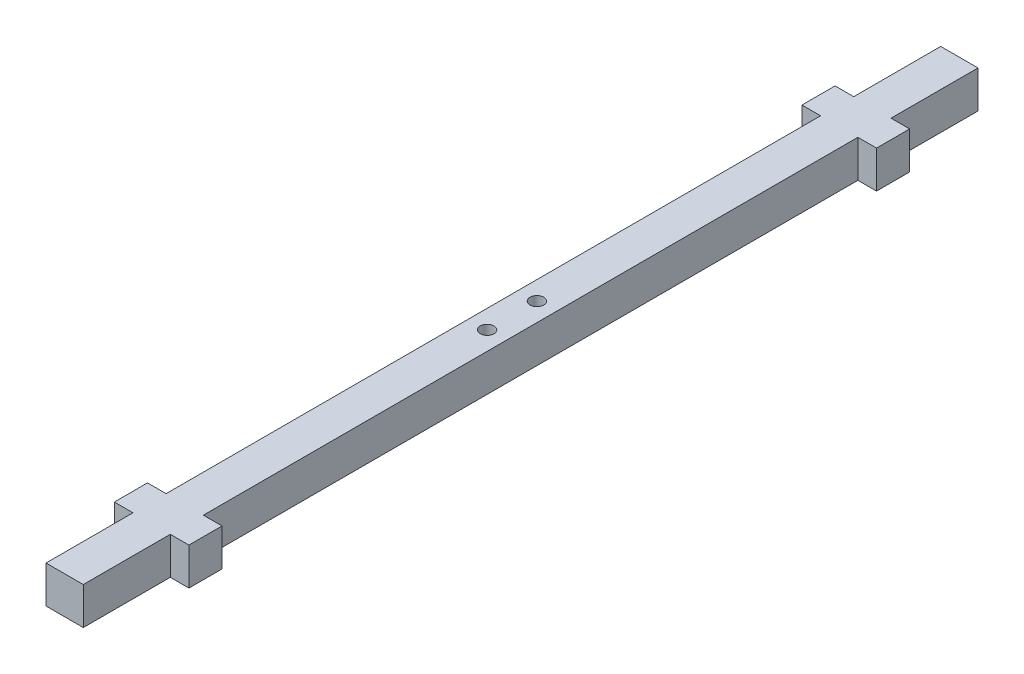
ISO-10303-21;
HEADER;
FILE_DESCRIPTION(('STEP AP214'),'2;1');
FILE_NAME('part.step','',(''),(''),'','','');
FILE_SCHEMA(('AUTOMOTIVE_DESIGN { 1 0 10303 214 1 1 1 1 }'));
ENDSEC;
DATA;
#1=APPLICATION_CONTEXT('core data for automotive mechanical design processes');
#2=APPLICATION_PROTOCOL_DEFINITION('international standard','automotive_design',2000,#1);
#3=PRODUCT_CONTEXT('',#1,'mechanical');
#4=PRODUCT('Part','Part','',(#3));
#5=PRODUCT_RELATED_PRODUCT_CATEGORY('part','',(#4));
#6=PRODUCT_DEFINITION_FORMATION('','',#4);
#7=PRODUCT_DEFINITION_CONTEXT('part definition',#1,'design');
#8=PRODUCT_DEFINITION('design','',#6,#7);
#9=PRODUCT_DEFINITION_SHAPE('','',#8);
#10=(LENGTH_UNIT() NAMED_UNIT(*) SI_UNIT(.MILLI.,.METRE.));
#11=(NAMED_UNIT(*) PLANE_ANGLE_UNIT() SI_UNIT($,.RADIAN.));
#12=(NAMED_UNIT(*) SI_UNIT($,.STERADIAN.) SOLID_ANGLE_UNIT());
#13=UNCERTAINTY_MEASURE_WITH_UNIT(LENGTH_MEASURE(1.E-05),#10,'distance_accuracy_value','');
#14=(GEOMETRIC_REPRESENTATION_CONTEXT(3) GLOBAL_UNCERTAINTY_ASSIGNED_CONTEXT((#13)) GLOBAL_UNIT_ASSIGNED_CONTEXT((#10,
#11,#12)) REPRESENTATION_CONTEXT('',''));
#15=CARTESIAN_POINT('',(0.,0.,0.));
#16=DIRECTION('',(0.,0.,1.));
#17=DIRECTION('',(1.,0.,0.));
#18=AXIS2_PLACEMENT_3D('',#15,#16,#17);
#19=CARTESIAN_POINT('',(4.5,-4.5,108.));
#20=DIRECTION('',(-1.,0.,0.));
#21=DIRECTION('',(0.,0.,1.));
#22=AXIS2_PLACEMENT_3D('',#19,#20,#21);
#23=PLANE('',#22);
#24=DIRECTION('',(0.,1.,0.));
#25=VECTOR('',#24,1.);
#26=CARTESIAN_POINT('',(4.5,-4.5,79.));
#27=LINE('',#26,#25);
#28=CARTESIAN_POINT('',(4.5,-4.5,79.));
#29=VERTEX_POINT('',#28);
#30=CARTESIAN_POINT('',(4.5,4.5,79.));
#31=VERTEX_POINT('',#30);
#32=EDGE_CURVE('E224',#29,#31,#27,.T.);
#33=ORIENTED_EDGE('',*,*,#32,.F.);
#34=DIRECTION('',(0.,0.,-1.));
#35=VECTOR('',#34,1.);
#36=CARTESIAN_POINT('',(4.5,-4.5,108.));
#37=LINE('',#36,#35);
#38=CARTESIAN_POINT('',(4.5,-4.5,-79.));
#39=VERTEX_POINT('',#38);
#40=EDGE_CURVE('E301',#29,#39,#37,.T.);
#41=ORIENTED_EDGE('',*,*,#40,.T.);
#42=DIRECTION('',(0.,-1.,0.));
#43=VECTOR('',#42,1.);
#44=CARTESIAN_POINT('',(4.5,-4.5,-79.));
#45=LINE('',#44,#43);
#46=CARTESIAN_POINT('',(4.5,4.5,-79.));
#47=VERTEX_POINT('',#46);
#48=EDGE_CURVE('E267',#47,#39,#45,.T.);
#49=ORIENTED_EDGE('',*,*,#48,.F.);
#50=DIRECTION('',(0.,0.,-1.));
#51=VECTOR('',#50,1.);
#52=CARTESIAN_POINT('',(4.5,4.5,108.));
#53=LINE('',#52,#51);
#54=EDGE_CURVE('E47',#31,#47,#53,.T.);
#55=ORIENTED_EDGE('',*,*,#54,.F.);
#56=EDGE_LOOP('',(#33,#41,#49,#55));
#57=FACE_BOUND('',#56,.T.);
#58=ADVANCED_FACE('F39',(#57),#23,.F.);
#59=DIRECTION('',(0.,-1.,0.));
#60=VECTOR('',#59,1.);
#61=CARTESIAN_POINT('',(4.5,-4.5,87.));
#62=LINE('',#61,#60);
#63=CARTESIAN_POINT('',(4.5,4.5,87.));
#64=VERTEX_POINT('',#63);
#65=CARTESIAN_POINT('',(4.5,-4.5,87.));
#66=VERTEX_POINT('',#65);
#67=EDGE_CURVE('E62',#64,#66,#62,.T.);
#68=ORIENTED_EDGE('',*,*,#67,.F.);
#69=CARTESIAN_POINT('',(4.5,4.5,108.));
#70=VERTEX_POINT('',#69);
#71=EDGE_CURVE('E11',#70,#64,#53,.T.);
#72=ORIENTED_EDGE('',*,*,#71,.F.);
#73=DIRECTION('',(0.,1.,0.));
#74=VECTOR('',#73,1.);
#75=CARTESIAN_POINT('',(4.5,-4.5,108.));
#76=LINE('',#75,#74);
#77=CARTESIAN_POINT('',(4.5,-4.5,108.));
#78=VERTEX_POINT('',#77);
#79=EDGE_CURVE('E277',#78,#70,#76,.T.);
#80=ORIENTED_EDGE('',*,*,#79,.F.);
#81=EDGE_CURVE('E298',#78,#66,#37,.T.);
#82=ORIENTED_EDGE('',*,*,#81,.T.);
#83=EDGE_LOOP('',(#68,#72,#80,#82));
#84=FACE_BOUND('',#83,.T.);
#85=ADVANCED_FACE('F359',(#84),#23,.F.);
#86=CARTESIAN_POINT('',(-4.5,-4.5,108.));
#87=DIRECTION('',(1.,0.,0.));
#88=DIRECTION('',(0.,0.,-1.));
#89=AXIS2_PLACEMENT_3D('',#86,#87,#88);
#90=PLANE('',#89);
#91=DIRECTION('',(0.,-1.,0.));
#92=VECTOR('',#91,1.);
#93=CARTESIAN_POINT('',(-4.5,-4.5,79.));
#94=LINE('',#93,#92);
#95=CARTESIAN_POINT('',(-4.5,4.5,79.));
#96=VERTEX_POINT('',#95);
#97=CARTESIAN_POINT('',(-4.5,-4.5,79.));
#98=VERTEX_POINT('',#97);
#99=EDGE_CURVE('E221',#96,#98,#94,.T.);
#100=ORIENTED_EDGE('',*,*,#99,.F.);
#101=DIRECTION('',(0.,0.,-1.));
#102=VECTOR('',#101,1.);
#103=CARTESIAN_POINT('',(-4.5,4.5,108.));
#104=LINE('',#103,#102);
#105=CARTESIAN_POINT('',(-4.5,4.5,-79.));
#106=VERTEX_POINT('',#105);
#107=EDGE_CURVE('E307',#96,#106,#104,.T.);
#108=ORIENTED_EDGE('',*,*,#107,.T.);
#109=DIRECTION('',(0.,1.,0.));
#110=VECTOR('',#109,1.);
#111=CARTESIAN_POINT('',(-4.5,-4.5,-79.));
#112=LINE('',#111,#110);
#113=CARTESIAN_POINT('',(-4.5,-4.5,-79.));
#114=VERTEX_POINT('',#113);
#115=EDGE_CURVE('E264',#114,#106,#112,.T.);
#116=ORIENTED_EDGE('',*,*,#115,.F.);
#117=DIRECTION('',(0.,0.,-1.));
#118=VECTOR('',#117,1.);
#119=CARTESIAN_POINT('',(-4.5,-4.5,108.));
#120=LINE('',#119,#118);
#121=EDGE_CURVE('E304',#98,#114,#120,.T.);
#122=ORIENTED_EDGE('',*,*,#121,.F.);
#123=EDGE_LOOP('',(#100,#108,#116,#122));
#124=FACE_BOUND('',#123,.T.);
#125=ADVANCED_FACE('F337',(#124),#90,.F.);
#126=DIRECTION('',(0.,1.,0.));
#127=VECTOR('',#126,1.);
#128=CARTESIAN_POINT('',(-4.5,-4.5,87.));
#129=LINE('',#128,#127);
#130=CARTESIAN_POINT('',(-4.5,-4.5,87.));
#131=VERTEX_POINT('',#130);
#132=CARTESIAN_POINT('',(-4.5,4.5,87.));
#133=VERTEX_POINT('',#132);
#134=EDGE_CURVE('E203',#131,#133,#129,.T.);
#135=ORIENTED_EDGE('',*,*,#134,.F.);
#136=CARTESIAN_POINT('',(-4.5,-4.5,108.));
#137=VERTEX_POINT('',#136);
#138=EDGE_CURVE('E302',#137,#131,#120,.T.);
#139=ORIENTED_EDGE('',*,*,#138,.F.);
#140=DIRECTION('',(0.,-1.,0.));
#141=VECTOR('',#140,1.);
#142=CARTESIAN_POINT('',(-4.5,-4.5,108.));
#143=LINE('',#142,#141);
#144=CARTESIAN_POINT('',(-4.5,4.5,108.));
#145=VERTEX_POINT('',#144);
#146=EDGE_CURVE('E283',#145,#137,#143,.T.);
#147=ORIENTED_EDGE('',*,*,#146,.F.);
#148=EDGE_CURVE('E305',#145,#133,#104,.T.);
#149=ORIENTED_EDGE('',*,*,#148,.T.);
#150=EDGE_LOOP('',(#135,#139,#147,#149));
#151=FACE_BOUND('',#150,.T.);
#152=ADVANCED_FACE('F365',(#151),#90,.F.);
#153=DIRECTION('',(0.,1.,0.));
#154=VECTOR('',#153,1.);
#155=CARTESIAN_POINT('',(4.5,-4.5,-87.));
#156=LINE('',#155,#154);
#157=CARTESIAN_POINT('',(4.5,-4.5,-87.));
#158=VERTEX_POINT('',#157);
#159=CARTESIAN_POINT('',(4.5,4.5,-87.));
#160=VERTEX_POINT('',#159);
#161=EDGE_CURVE('E273',#158,#160,#156,.T.);
#162=ORIENTED_EDGE('',*,*,#161,.F.);
#163=CARTESIAN_POINT('',(4.5,-4.5,-108.));
#164=VERTEX_POINT('',#163);
#165=EDGE_CURVE('E287',#158,#164,#37,.T.);
#166=ORIENTED_EDGE('',*,*,#165,.T.);
#167=DIRECTION('',(0.,1.,0.));
#168=VECTOR('',#167,1.);
#169=CARTESIAN_POINT('',(4.5,-4.5,-108.));
#170=LINE('',#169,#168);
#171=CARTESIAN_POINT('',(4.5,4.5,-108.));
#172=VERTEX_POINT('',#171);
#173=EDGE_CURVE('E276',#164,#172,#170,.T.);
#174=ORIENTED_EDGE('',*,*,#173,.T.);
#175=EDGE_CURVE('E48',#160,#172,#53,.T.);
#176=ORIENTED_EDGE('',*,*,#175,.F.);
#177=EDGE_LOOP('',(#162,#166,#174,#176));
#178=FACE_BOUND('',#177,.T.);
#179=ADVANCED_FACE('F41',(#178),#23,.F.);
#180=DIRECTION('',(0.,-1.,0.));
#181=VECTOR('',#180,1.);
#182=CARTESIAN_POINT('',(-4.5,-4.5,-87.));
#183=LINE('',#182,#181);
#184=CARTESIAN_POINT('',(-4.5,4.5,-87.));
#185=VERTEX_POINT('',#184);
#186=CARTESIAN_POINT('',(-4.5,-4.5,-87.));
#187=VERTEX_POINT('',#186);
#188=EDGE_CURVE('E270',#185,#187,#183,.T.);
#189=ORIENTED_EDGE('',*,*,#188,.F.);
#190=CARTESIAN_POINT('',(-4.5,4.5,-108.));
#191=VERTEX_POINT('',#190);
#192=EDGE_CURVE('E303',#185,#191,#104,.T.);
#193=ORIENTED_EDGE('',*,*,#192,.T.);
#194=DIRECTION('',(0.,-1.,0.));
#195=VECTOR('',#194,1.);
#196=CARTESIAN_POINT('',(-4.5,-4.5,-108.));
#197=LINE('',#196,#195);
#198=CARTESIAN_POINT('',(-4.5,-4.5,-108.));
#199=VERTEX_POINT('',#198);
#200=EDGE_CURVE('E293',#191,#199,#197,.T.);
#201=ORIENTED_EDGE('',*,*,#200,.T.);
#202=EDGE_CURVE('E300',#187,#199,#120,.T.);
#203=ORIENTED_EDGE('',*,*,#202,.F.);
#204=EDGE_LOOP('',(#189,#193,#201,#203));
#205=FACE_BOUND('',#204,.T.);
#206=ADVANCED_FACE('F315',(#205),#90,.F.);
#207=CARTESIAN_POINT('',(-4.5,4.5,108.));
#208=DIRECTION('',(0.,-1.,0.));
#209=DIRECTION('',(0.,0.,-1.));
#210=AXIS2_PLACEMENT_3D('',#207,#208,#209);
#211=PLANE('',#210);
#212=CARTESIAN_POINT('',(0.,4.5,-6.));
#213=DIRECTION('',(0.,-1.,0.));
#214=DIRECTION('',(0.,0.,-1.));
#215=AXIS2_PLACEMENT_3D('',#212,#213,#214);
#216=CIRCLE('',#215,1.65);
#217=CARTESIAN_POINT('',(0.,4.5,-7.65));
#218=VERTEX_POINT('',#217);
#219=EDGE_CURVE('E385',#218,#218,#216,.T.);
#220=ORIENTED_EDGE('',*,*,#219,.T.);
#221=EDGE_LOOP('',(#220));
#222=FACE_BOUND('',#221,.T.);
#223=CARTESIAN_POINT('',(0.,4.5,6.));
#224=DIRECTION('',(0.,-1.,0.));
#225=DIRECTION('',(0.,0.,-1.));
#226=AXIS2_PLACEMENT_3D('',#223,#224,#225);
#227=CIRCLE('',#226,1.65);
#228=CARTESIAN_POINT('',(0.,4.5,4.35));
#229=VERTEX_POINT('',#228);
#230=EDGE_CURVE('E390',#229,#229,#227,.T.);
#231=ORIENTED_EDGE('',*,*,#230,.T.);
#232=EDGE_LOOP('',(#231));
#233=FACE_BOUND('',#232,.T.);
#234=ORIENTED_EDGE('',*,*,#71,.T.);
#235=DIRECTION('',(1.,0.,0.));
#236=VECTOR('',#235,1.);
#237=CARTESIAN_POINT('',(-9.00000000000001,4.5,87.));
#238=LINE('',#237,#236);
#239=CARTESIAN_POINT('',(9.,4.5,87.));
#240=VERTEX_POINT('',#239);
#241=EDGE_CURVE('E195',#64,#240,#238,.T.);
#242=ORIENTED_EDGE('',*,*,#241,.T.);
#243=DIRECTION('',(0.,0.,-1.));
#244=VECTOR('',#243,1.);
#245=CARTESIAN_POINT('',(9.,4.5,87.));
#246=LINE('',#245,#244);
#247=CARTESIAN_POINT('',(9.,4.5,79.));
#248=VERTEX_POINT('',#247);
#249=EDGE_CURVE('E187',#240,#248,#246,.T.);
#250=ORIENTED_EDGE('',*,*,#249,.T.);
#251=DIRECTION('',(-1.,0.,0.));
#252=VECTOR('',#251,1.);
#253=CARTESIAN_POINT('',(-9.00000000000001,4.5,79.));
#254=LINE('',#253,#252);
#255=EDGE_CURVE('E216',#248,#31,#254,.T.);
#256=ORIENTED_EDGE('',*,*,#255,.T.);
#257=ORIENTED_EDGE('',*,*,#54,.T.);
#258=DIRECTION('',(1.,0.,0.));
#259=VECTOR('',#258,1.);
#260=CARTESIAN_POINT('',(-9.,4.5,-79.));
#261=LINE('',#260,#259);
#262=CARTESIAN_POINT('',(9.,4.5,-79.));
#263=VERTEX_POINT('',#262);
#264=EDGE_CURVE('E237',#47,#263,#261,.T.);
#265=ORIENTED_EDGE('',*,*,#264,.T.);
#266=DIRECTION('',(0.,0.,-1.));
#267=VECTOR('',#266,1.);
#268=CARTESIAN_POINT('',(9.,4.5,-79.));
#269=LINE('',#268,#267);
#270=CARTESIAN_POINT('',(9.,4.5,-87.));
#271=VERTEX_POINT('',#270);
#272=EDGE_CURVE('E227',#263,#271,#269,.T.);
#273=ORIENTED_EDGE('',*,*,#272,.T.);
#274=DIRECTION('',(-1.,0.,0.));
#275=VECTOR('',#274,1.);
#276=CARTESIAN_POINT('',(-9.,4.5,-87.));
#277=LINE('',#276,#275);
#278=EDGE_CURVE('E232',#271,#160,#277,.T.);
#279=ORIENTED_EDGE('',*,*,#278,.T.);
#280=ORIENTED_EDGE('',*,*,#175,.T.);
#281=DIRECTION('',(-1.,0.,0.));
#282=VECTOR('',#281,1.);
#283=CARTESIAN_POINT('',(-4.5,4.5,-108.));
#284=LINE('',#283,#282);
#285=EDGE_CURVE('E290',#172,#191,#284,.T.);
#286=ORIENTED_EDGE('',*,*,#285,.T.);
#287=ORIENTED_EDGE('',*,*,#192,.F.);
#288=CARTESIAN_POINT('',(-9.,4.5,-87.));
#289=VERTEX_POINT('',#288);
#290=EDGE_CURVE('E230',#185,#289,#277,.T.);
#291=ORIENTED_EDGE('',*,*,#290,.T.);
#292=DIRECTION('',(0.,0.,1.));
#293=VECTOR('',#292,1.);
#294=CARTESIAN_POINT('',(-9.,4.5,-79.));
#295=LINE('',#294,#293);
#296=CARTESIAN_POINT('',(-9.,4.5,-79.));
#297=VERTEX_POINT('',#296);
#298=EDGE_CURVE('E235',#289,#297,#295,.T.);
#299=ORIENTED_EDGE('',*,*,#298,.T.);
#300=EDGE_CURVE('E238',#297,#106,#261,.T.);
#301=ORIENTED_EDGE('',*,*,#300,.T.);
#302=ORIENTED_EDGE('',*,*,#107,.F.);
#303=CARTESIAN_POINT('',(-9.00000000000001,4.5,79.));
#304=VERTEX_POINT('',#303);
#305=EDGE_CURVE('E215',#96,#304,#254,.T.);
#306=ORIENTED_EDGE('',*,*,#305,.T.);
#307=DIRECTION('',(0.,0.,1.));
#308=VECTOR('',#307,1.);
#309=CARTESIAN_POINT('',(-9.00000000000001,4.5,87.));
#310=LINE('',#309,#308);
#311=CARTESIAN_POINT('',(-9.00000000000001,4.5,87.));
#312=VERTEX_POINT('',#311);
#313=EDGE_CURVE('E213',#304,#312,#310,.T.);
#314=ORIENTED_EDGE('',*,*,#313,.T.);
#315=EDGE_CURVE('E210',#312,#133,#238,.T.);
#316=ORIENTED_EDGE('',*,*,#315,.T.);
#317=ORIENTED_EDGE('',*,*,#148,.F.);
#318=DIRECTION('',(-1.,0.,0.));
#319=VECTOR('',#318,1.);
#320=CARTESIAN_POINT('',(-4.5,4.5,108.));
#321=LINE('',#320,#319);
#322=EDGE_CURVE('E280',#70,#145,#321,.T.);
#323=ORIENTED_EDGE('',*,*,#322,.F.);
#324=EDGE_LOOP('',(#234,#242,#250,#256,#257,#265,#273,#279,#280,#286,#287,#291,#299,#301,#302,
#306,#314,#316,#317,#323));
#325=FACE_BOUND('',#324,.T.);
#326=ADVANCED_FACE('F321',(#222,#233,#325),#211,.F.);
#327=CARTESIAN_POINT('',(-4.5,-4.5,108.));
#328=DIRECTION('',(0.,1.,0.));
#329=DIRECTION('',(0.,0.,1.));
#330=AXIS2_PLACEMENT_3D('',#327,#328,#329);
#331=PLANE('',#330);
#332=CARTESIAN_POINT('',(0.,-4.5,-6.));
#333=DIRECTION('',(0.,1.,0.));
#334=DIRECTION('',(0.,0.,1.));
#335=AXIS2_PLACEMENT_3D('',#332,#333,#334);
#336=CIRCLE('',#335,1.65);
#337=CARTESIAN_POINT('',(0.,-4.5,-4.35));
#338=VERTEX_POINT('',#337);
#339=EDGE_CURVE('E429',#338,#338,#336,.T.);
#340=ORIENTED_EDGE('',*,*,#339,.T.);
#341=EDGE_LOOP('',(#340));
#342=FACE_BOUND('',#341,.T.);
#343=CARTESIAN_POINT('',(0.,-4.5,6.));
#344=DIRECTION('',(0.,1.,0.));
#345=DIRECTION('',(0.,0.,1.));
#346=AXIS2_PLACEMENT_3D('',#343,#344,#345);
#347=CIRCLE('',#346,1.65);
#348=CARTESIAN_POINT('',(0.,-4.5,7.65));
#349=VERTEX_POINT('',#348);
#350=EDGE_CURVE('E431',#349,#349,#347,.T.);
#351=ORIENTED_EDGE('',*,*,#350,.T.);
#352=EDGE_LOOP('',(#351));
#353=FACE_BOUND('',#352,.T.);
#354=ORIENTED_EDGE('',*,*,#138,.T.);
#355=DIRECTION('',(1.,0.,0.));
#356=VECTOR('',#355,1.);
#357=CARTESIAN_POINT('',(-9.00000000000001,-4.5,87.));
#358=LINE('',#357,#356);
#359=CARTESIAN_POINT('',(-9.00000000000001,-4.5,87.));
#360=VERTEX_POINT('',#359);
#361=EDGE_CURVE('E186',#360,#131,#358,.T.);
#362=ORIENTED_EDGE('',*,*,#361,.F.);
#363=DIRECTION('',(0.,0.,1.));
#364=VECTOR('',#363,1.);
#365=CARTESIAN_POINT('',(-9.00000000000001,-4.5,87.));
#366=LINE('',#365,#364);
#367=CARTESIAN_POINT('',(-9.00000000000001,-4.5,79.));
#368=VERTEX_POINT('',#367);
#369=EDGE_CURVE('E395',#368,#360,#366,.T.);
#370=ORIENTED_EDGE('',*,*,#369,.F.);
#371=DIRECTION('',(-1.,0.,0.));
#372=VECTOR('',#371,1.);
#373=CARTESIAN_POINT('',(-9.00000000000001,-4.5,79.));
#374=LINE('',#373,#372);
#375=EDGE_CURVE('E206',#98,#368,#374,.T.);
#376=ORIENTED_EDGE('',*,*,#375,.F.);
#377=ORIENTED_EDGE('',*,*,#121,.T.);
#378=DIRECTION('',(1.,0.,0.));
#379=VECTOR('',#378,1.);
#380=CARTESIAN_POINT('',(-9.,-4.5,-79.));
#381=LINE('',#380,#379);
#382=CARTESIAN_POINT('',(-9.,-4.5,-79.));
#383=VERTEX_POINT('',#382);
#384=EDGE_CURVE('E231',#383,#114,#381,.T.);
#385=ORIENTED_EDGE('',*,*,#384,.F.);
#386=DIRECTION('',(0.,0.,1.));
#387=VECTOR('',#386,1.);
#388=CARTESIAN_POINT('',(-9.,-4.5,-79.));
#389=LINE('',#388,#387);
#390=CARTESIAN_POINT('',(-9.,-4.5,-87.));
#391=VERTEX_POINT('',#390);
#392=EDGE_CURVE('E248',#391,#383,#389,.T.);
#393=ORIENTED_EDGE('',*,*,#392,.F.);
#394=DIRECTION('',(-1.,0.,0.));
#395=VECTOR('',#394,1.);
#396=CARTESIAN_POINT('',(-9.,-4.5,-87.));
#397=LINE('',#396,#395);
#398=EDGE_CURVE('E244',#187,#391,#397,.T.);
#399=ORIENTED_EDGE('',*,*,#398,.F.);
#400=ORIENTED_EDGE('',*,*,#202,.T.);
#401=DIRECTION('',(1.,0.,0.));
#402=VECTOR('',#401,1.);
#403=CARTESIAN_POINT('',(-4.5,-4.5,-108.));
#404=LINE('',#403,#402);
#405=EDGE_CURVE('E281',#199,#164,#404,.T.);
#406=ORIENTED_EDGE('',*,*,#405,.T.);
#407=ORIENTED_EDGE('',*,*,#165,.F.);
#408=CARTESIAN_POINT('',(9.,-4.5,-87.));
#409=VERTEX_POINT('',#408);
#410=EDGE_CURVE('E245',#409,#158,#397,.T.);
#411=ORIENTED_EDGE('',*,*,#410,.F.);
#412=DIRECTION('',(0.,0.,-1.));
#413=VECTOR('',#412,1.);
#414=CARTESIAN_POINT('',(9.,-4.5,-79.));
#415=LINE('',#414,#413);
#416=CARTESIAN_POINT('',(9.,-4.5,-79.));
#417=VERTEX_POINT('',#416);
#418=EDGE_CURVE('E226',#417,#409,#415,.T.);
#419=ORIENTED_EDGE('',*,*,#418,.F.);
#420=EDGE_CURVE('E250',#39,#417,#381,.T.);
#421=ORIENTED_EDGE('',*,*,#420,.F.);
#422=ORIENTED_EDGE('',*,*,#40,.F.);
#423=CARTESIAN_POINT('',(9.,-4.5,79.));
#424=VERTEX_POINT('',#423);
#425=EDGE_CURVE('E201',#424,#29,#374,.T.);
#426=ORIENTED_EDGE('',*,*,#425,.F.);
#427=DIRECTION('',(0.,0.,-1.));
#428=VECTOR('',#427,1.);
#429=CARTESIAN_POINT('',(9.,-4.5,87.));
#430=LINE('',#429,#428);
#431=CARTESIAN_POINT('',(9.,-4.5,87.));
#432=VERTEX_POINT('',#431);
#433=EDGE_CURVE('E193',#432,#424,#430,.T.);
#434=ORIENTED_EDGE('',*,*,#433,.F.);
#435=EDGE_CURVE('E177',#66,#432,#358,.T.);
#436=ORIENTED_EDGE('',*,*,#435,.F.);
#437=ORIENTED_EDGE('',*,*,#81,.F.);
#438=DIRECTION('',(1.,0.,0.));
#439=VECTOR('',#438,1.);
#440=CARTESIAN_POINT('',(-4.5,-4.5,108.));
#441=LINE('',#440,#439);
#442=EDGE_CURVE('E285',#137,#78,#441,.T.);
#443=ORIENTED_EDGE('',*,*,#442,.F.);
#444=EDGE_LOOP('',(#354,#362,#370,#376,#377,#385,#393,#399,#400,#406,#407,#411,#419,#421,#422,
#426,#434,#436,#437,#443));
#445=FACE_BOUND('',#444,.T.);
#446=ADVANCED_FACE('F199',(#342,#353,#445),#331,.F.);
#447=CARTESIAN_POINT('',(0.,0.,108.));
#448=DIRECTION('',(0.,0.,-1.));
#449=DIRECTION('',(-1.,0.,0.));
#450=AXIS2_PLACEMENT_3D('',#447,#448,#449);
#451=PLANE('',#450);
#452=ORIENTED_EDGE('',*,*,#79,.T.);
#453=ORIENTED_EDGE('',*,*,#322,.T.);
#454=ORIENTED_EDGE('',*,*,#146,.T.);
#455=ORIENTED_EDGE('',*,*,#442,.T.);
#456=EDGE_LOOP('',(#452,#453,#454,#455));
#457=FACE_BOUND('',#456,.T.);
#458=ADVANCED_FACE('F410',(#457),#451,.F.);
#459=CARTESIAN_POINT('',(0.,0.,-108.));
#460=DIRECTION('',(0.,0.,-1.));
#461=DIRECTION('',(-1.,0.,0.));
#462=AXIS2_PLACEMENT_3D('',#459,#460,#461);
#463=PLANE('',#462);
#464=ORIENTED_EDGE('',*,*,#173,.F.);
#465=ORIENTED_EDGE('',*,*,#405,.F.);
#466=ORIENTED_EDGE('',*,*,#200,.F.);
#467=ORIENTED_EDGE('',*,*,#285,.F.);
#468=EDGE_LOOP('',(#464,#465,#466,#467));
#469=FACE_BOUND('',#468,.T.);
#470=ADVANCED_FACE('F324',(#469),#463,.T.);
#471=CARTESIAN_POINT('',(-9.,4.5,-79.));
#472=DIRECTION('',(1.,0.,0.));
#473=DIRECTION('',(0.,0.,-1.));
#474=AXIS2_PLACEMENT_3D('',#471,#472,#473);
#475=PLANE('',#474);
#476=ORIENTED_EDGE('',*,*,#392,.T.);
#477=DIRECTION('',(0.,-1.,0.));
#478=VECTOR('',#477,1.);
#479=CARTESIAN_POINT('',(-9.,4.5,-79.));
#480=LINE('',#479,#478);
#481=EDGE_CURVE('E255',#297,#383,#480,.T.);
#482=ORIENTED_EDGE('',*,*,#481,.F.);
#483=ORIENTED_EDGE('',*,*,#298,.F.);
#484=DIRECTION('',(0.,-1.,0.));
#485=VECTOR('',#484,1.);
#486=CARTESIAN_POINT('',(-9.,4.5,-87.));
#487=LINE('',#486,#485);
#488=EDGE_CURVE('E258',#289,#391,#487,.T.);
#489=ORIENTED_EDGE('',*,*,#488,.T.);
#490=EDGE_LOOP('',(#476,#482,#483,#489));
#491=FACE_BOUND('',#490,.T.);
#492=ADVANCED_FACE('F343',(#491),#475,.F.);
#493=CARTESIAN_POINT('',(-9.,4.5,-79.));
#494=DIRECTION('',(0.,0.,-1.));
#495=DIRECTION('',(-1.,0.,0.));
#496=AXIS2_PLACEMENT_3D('',#493,#494,#495);
#497=PLANE('',#496);
#498=ORIENTED_EDGE('',*,*,#384,.T.);
#499=ORIENTED_EDGE('',*,*,#115,.T.);
#500=ORIENTED_EDGE('',*,*,#300,.F.);
#501=ORIENTED_EDGE('',*,*,#481,.T.);
#502=EDGE_LOOP('',(#498,#499,#500,#501));
#503=FACE_BOUND('',#502,.T.);
#504=ADVANCED_FACE('F334',(#503),#497,.F.);
#505=CARTESIAN_POINT('',(-9.,4.5,-87.));
#506=DIRECTION('',(0.,0.,1.));
#507=DIRECTION('',(1.,0.,0.));
#508=AXIS2_PLACEMENT_3D('',#505,#506,#507);
#509=PLANE('',#508);
#510=ORIENTED_EDGE('',*,*,#290,.F.);
#511=ORIENTED_EDGE('',*,*,#188,.T.);
#512=ORIENTED_EDGE('',*,*,#398,.T.);
#513=ORIENTED_EDGE('',*,*,#488,.F.);
#514=EDGE_LOOP('',(#510,#511,#512,#513));
#515=FACE_BOUND('',#514,.T.);
#516=ADVANCED_FACE('F345',(#515),#509,.F.);
#517=ORIENTED_EDGE('',*,*,#410,.T.);
#518=ORIENTED_EDGE('',*,*,#161,.T.);
#519=ORIENTED_EDGE('',*,*,#278,.F.);
#520=DIRECTION('',(0.,-1.,0.));
#521=VECTOR('',#520,1.);
#522=CARTESIAN_POINT('',(9.,4.5,-87.));
#523=LINE('',#522,#521);
#524=EDGE_CURVE('E261',#271,#409,#523,.T.);
#525=ORIENTED_EDGE('',*,*,#524,.T.);
#526=EDGE_LOOP('',(#517,#518,#519,#525));
#527=FACE_BOUND('',#526,.T.);
#528=ADVANCED_FACE('F347',(#527),#509,.F.);
#529=ORIENTED_EDGE('',*,*,#264,.F.);
#530=ORIENTED_EDGE('',*,*,#48,.T.);
#531=ORIENTED_EDGE('',*,*,#420,.T.);
#532=DIRECTION('',(0.,-1.,0.));
#533=VECTOR('',#532,1.);
#534=CARTESIAN_POINT('',(9.,4.5,-79.));
#535=LINE('',#534,#533);
#536=EDGE_CURVE('E241',#263,#417,#535,.T.);
#537=ORIENTED_EDGE('',*,*,#536,.F.);
#538=EDGE_LOOP('',(#529,#530,#531,#537));
#539=FACE_BOUND('',#538,.T.);
#540=ADVANCED_FACE('F353',(#539),#497,.F.);
#541=CARTESIAN_POINT('',(9.,4.5,-79.));
#542=DIRECTION('',(-1.,0.,0.));
#543=DIRECTION('',(0.,0.,1.));
#544=AXIS2_PLACEMENT_3D('',#541,#542,#543);
#545=PLANE('',#544);
#546=ORIENTED_EDGE('',*,*,#418,.T.);
#547=ORIENTED_EDGE('',*,*,#524,.F.);
#548=ORIENTED_EDGE('',*,*,#272,.F.);
#549=ORIENTED_EDGE('',*,*,#536,.T.);
#550=EDGE_LOOP('',(#546,#547,#548,#549));
#551=FACE_BOUND('',#550,.T.);
#552=ADVANCED_FACE('F376',(#551),#545,.F.);
#553=CARTESIAN_POINT('',(-9.00000000000001,4.5,87.));
#554=DIRECTION('',(1.,0.,0.));
#555=DIRECTION('',(0.,0.,-1.));
#556=AXIS2_PLACEMENT_3D('',#553,#554,#555);
#557=PLANE('',#556);
#558=ORIENTED_EDGE('',*,*,#369,.T.);
#559=DIRECTION('',(0.,-1.,0.));
#560=VECTOR('',#559,1.);
#561=CARTESIAN_POINT('',(-9.00000000000001,4.5,87.));
#562=LINE('',#561,#560);
#563=EDGE_CURVE('E196',#312,#360,#562,.T.);
#564=ORIENTED_EDGE('',*,*,#563,.F.);
#565=ORIENTED_EDGE('',*,*,#313,.F.);
#566=DIRECTION('',(0.,-1.,0.));
#567=VECTOR('',#566,1.);
#568=CARTESIAN_POINT('',(-9.00000000000001,4.5,79.));
#569=LINE('',#568,#567);
#570=EDGE_CURVE('E384',#304,#368,#569,.T.);
#571=ORIENTED_EDGE('',*,*,#570,.T.);
#572=EDGE_LOOP('',(#558,#564,#565,#571));
#573=FACE_BOUND('',#572,.T.);
#574=ADVANCED_FACE('F401',(#573),#557,.F.);
#575=CARTESIAN_POINT('',(-9.00000000000001,4.5,87.));
#576=DIRECTION('',(0.,0.,-1.));
#577=DIRECTION('',(-1.,0.,0.));
#578=AXIS2_PLACEMENT_3D('',#575,#576,#577);
#579=PLANE('',#578);
#580=ORIENTED_EDGE('',*,*,#361,.T.);
#581=ORIENTED_EDGE('',*,*,#134,.T.);
#582=ORIENTED_EDGE('',*,*,#315,.F.);
#583=ORIENTED_EDGE('',*,*,#563,.T.);
#584=EDGE_LOOP('',(#580,#581,#582,#583));
#585=FACE_BOUND('',#584,.T.);
#586=ADVANCED_FACE('F406',(#585),#579,.F.);
#587=CARTESIAN_POINT('',(-9.00000000000001,4.5,79.));
#588=DIRECTION('',(0.,0.,1.));
#589=DIRECTION('',(1.,0.,0.));
#590=AXIS2_PLACEMENT_3D('',#587,#588,#589);
#591=PLANE('',#590);
#592=ORIENTED_EDGE('',*,*,#305,.F.);
#593=ORIENTED_EDGE('',*,*,#99,.T.);
#594=ORIENTED_EDGE('',*,*,#375,.T.);
#595=ORIENTED_EDGE('',*,*,#570,.F.);
#596=EDGE_LOOP('',(#592,#593,#594,#595));
#597=FACE_BOUND('',#596,.T.);
#598=ADVANCED_FACE('F399',(#597),#591,.F.);
#599=ORIENTED_EDGE('',*,*,#425,.T.);
#600=ORIENTED_EDGE('',*,*,#32,.T.);
#601=ORIENTED_EDGE('',*,*,#255,.F.);
#602=DIRECTION('',(0.,-1.,0.));
#603=VECTOR('',#602,1.);
#604=CARTESIAN_POINT('',(9.,4.5,79.));
#605=LINE('',#604,#603);
#606=EDGE_CURVE('E383',#248,#424,#605,.T.);
#607=ORIENTED_EDGE('',*,*,#606,.T.);
#608=EDGE_LOOP('',(#599,#600,#601,#607));
#609=FACE_BOUND('',#608,.T.);
#610=ADVANCED_FACE('F382',(#609),#591,.F.);
#611=ORIENTED_EDGE('',*,*,#241,.F.);
#612=ORIENTED_EDGE('',*,*,#67,.T.);
#613=ORIENTED_EDGE('',*,*,#435,.T.);
#614=DIRECTION('',(0.,-1.,0.));
#615=VECTOR('',#614,1.);
#616=CARTESIAN_POINT('',(9.,4.5,87.));
#617=LINE('',#616,#615);
#618=EDGE_CURVE('E181',#240,#432,#617,.T.);
#619=ORIENTED_EDGE('',*,*,#618,.F.);
#620=EDGE_LOOP('',(#611,#612,#613,#619));
#621=FACE_BOUND('',#620,.T.);
#622=ADVANCED_FACE('F180',(#621),#579,.F.);
#623=CARTESIAN_POINT('',(9.,4.5,87.));
#624=DIRECTION('',(-1.,0.,0.));
#625=DIRECTION('',(0.,0.,1.));
#626=AXIS2_PLACEMENT_3D('',#623,#624,#625);
#627=PLANE('',#626);
#628=ORIENTED_EDGE('',*,*,#433,.T.);
#629=ORIENTED_EDGE('',*,*,#606,.F.);
#630=ORIENTED_EDGE('',*,*,#249,.F.);
#631=ORIENTED_EDGE('',*,*,#618,.T.);
#632=EDGE_LOOP('',(#628,#629,#630,#631));
#633=FACE_BOUND('',#632,.T.);
#634=ADVANCED_FACE('F191',(#633),#627,.F.);
#635=CARTESIAN_POINT('',(0.,-4.5,6.));
#636=DIRECTION('',(0.,1.,0.));
#637=DIRECTION('',(0.,0.,1.));
#638=AXIS2_PLACEMENT_3D('',#635,#636,#637);
#639=CYLINDRICAL_SURFACE('',#638,1.65);
#640=ORIENTED_EDGE('',*,*,#350,.F.);
#641=EDGE_LOOP('',(#640));
#642=FACE_BOUND('',#641,.T.);
#643=ORIENTED_EDGE('',*,*,#230,.F.);
#644=EDGE_LOOP('',(#643));
#645=FACE_BOUND('',#644,.T.);
#646=ADVANCED_FACE('F438',(#642,#645),#639,.F.);
#647=CARTESIAN_POINT('',(0.,-4.5,-6.));
#648=DIRECTION('',(0.,1.,0.));
#649=DIRECTION('',(0.,0.,1.));
#650=AXIS2_PLACEMENT_3D('',#647,#648,#649);
#651=CYLINDRICAL_SURFACE('',#650,1.65);
#652=ORIENTED_EDGE('',*,*,#339,.F.);
#653=EDGE_LOOP('',(#652));
#654=FACE_BOUND('',#653,.T.);
#655=ORIENTED_EDGE('',*,*,#219,.F.);
#656=EDGE_LOOP('',(#655));
#657=FACE_BOUND('',#656,.T.);
#658=ADVANCED_FACE('F440',(#654,#657),#651,.F.);
#659=CLOSED_SHELL('',(#58,#85,#125,#152,#179,#206,#326,#446,#458,#470,#492,#504,#516,#528,#540,
#552,#574,#586,#598,#610,#622,#634,#646,#658));
#660=MANIFOLD_SOLID_BREP('B2',#659);
#661=ADVANCED_BREP_SHAPE_REPRESENTATION('',(#18,#660),#14);
#662=SHAPE_DEFINITION_REPRESENTATION(#9,#661);
ENDSEC;
END-ISO-10303-21;
